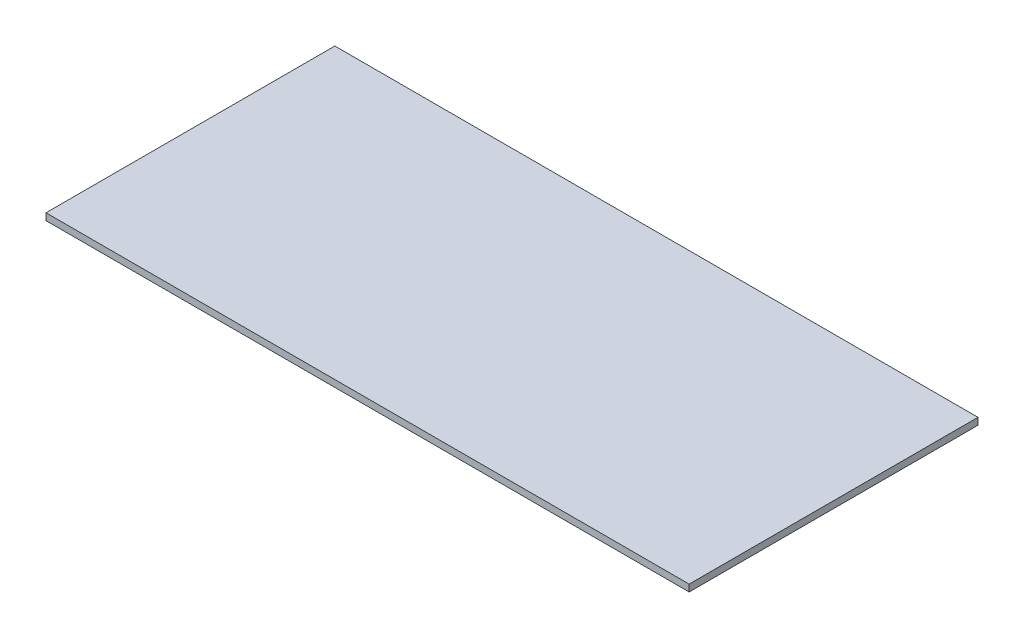
ISO-10303-21;
HEADER;
FILE_DESCRIPTION(('STEP AP214'),'2;1');
FILE_NAME('part.step','',(''),(''),'','','');
FILE_SCHEMA(('AUTOMOTIVE_DESIGN { 1 0 10303 214 1 1 1 1 }'));
ENDSEC;
DATA;
#1=APPLICATION_CONTEXT('core data for automotive mechanical design processes');
#2=APPLICATION_PROTOCOL_DEFINITION('international standard','automotive_design',2000,#1);
#3=PRODUCT_CONTEXT('',#1,'mechanical');
#4=PRODUCT('Part','Part','',(#3));
#5=PRODUCT_RELATED_PRODUCT_CATEGORY('part','',(#4));
#6=PRODUCT_DEFINITION_FORMATION('','',#4);
#7=PRODUCT_DEFINITION_CONTEXT('part definition',#1,'design');
#8=PRODUCT_DEFINITION('design','',#6,#7);
#9=PRODUCT_DEFINITION_SHAPE('','',#8);
#10=(LENGTH_UNIT() NAMED_UNIT(*) SI_UNIT(.MILLI.,.METRE.));
#11=(NAMED_UNIT(*) PLANE_ANGLE_UNIT() SI_UNIT($,.RADIAN.));
#12=(NAMED_UNIT(*) SI_UNIT($,.STERADIAN.) SOLID_ANGLE_UNIT());
#13=UNCERTAINTY_MEASURE_WITH_UNIT(LENGTH_MEASURE(1.E-05),#10,'distance_accuracy_value','');
#14=(GEOMETRIC_REPRESENTATION_CONTEXT(3) GLOBAL_UNCERTAINTY_ASSIGNED_CONTEXT((#13)) GLOBAL_UNIT_ASSIGNED_CONTEXT((#10,
#11,#12)) REPRESENTATION_CONTEXT('',''));
#15=CARTESIAN_POINT('',(0.,0.,0.));
#16=DIRECTION('',(0.,0.,1.));
#17=DIRECTION('',(1.,0.,0.));
#18=AXIS2_PLACEMENT_3D('',#15,#16,#17);
#19=CARTESIAN_POINT('',(119.48172011966,2.54,-53.6594551435598));
#20=DIRECTION('',(-1.,0.,0.));
#21=DIRECTION('',(0.,0.,1.));
#22=AXIS2_PLACEMENT_3D('',#19,#20,#21);
#23=PLANE('',#22);
#24=DIRECTION('',(0.,0.,-1.));
#25=VECTOR('',#24,1.);
#26=CARTESIAN_POINT('',(119.48172011966,0.,-53.6594551435598));
#27=LINE('',#26,#25);
#28=CARTESIAN_POINT('',(119.48172011966,0.,53.6594551435598));
#29=VERTEX_POINT('',#28);
#30=CARTESIAN_POINT('',(119.48172011966,0.,-53.6594551435598));
#31=VERTEX_POINT('',#30);
#32=EDGE_CURVE('E100',#29,#31,#27,.T.);
#33=ORIENTED_EDGE('',*,*,#32,.T.);
#34=DIRECTION('',(0.,-1.,0.));
#35=VECTOR('',#34,1.);
#36=CARTESIAN_POINT('',(119.48172011966,2.54,-53.6594551435598));
#37=LINE('',#36,#35);
#38=CARTESIAN_POINT('',(119.48172011966,2.54,-53.6594551435598));
#39=VERTEX_POINT('',#38);
#40=EDGE_CURVE('E11',#39,#31,#37,.T.);
#41=ORIENTED_EDGE('',*,*,#40,.F.);
#42=DIRECTION('',(0.,0.,-1.));
#43=VECTOR('',#42,1.);
#44=CARTESIAN_POINT('',(119.48172011966,2.54,-53.6594551435598));
#45=LINE('',#44,#43);
#46=CARTESIAN_POINT('',(119.48172011966,2.54,53.6594551435598));
#47=VERTEX_POINT('',#46);
#48=EDGE_CURVE('E88',#47,#39,#45,.T.);
#49=ORIENTED_EDGE('',*,*,#48,.F.);
#50=DIRECTION('',(0.,-1.,0.));
#51=VECTOR('',#50,1.);
#52=CARTESIAN_POINT('',(119.48172011966,2.54,53.6594551435598));
#53=LINE('',#52,#51);
#54=EDGE_CURVE('E96',#47,#29,#53,.T.);
#55=ORIENTED_EDGE('',*,*,#54,.T.);
#56=EDGE_LOOP('',(#33,#41,#49,#55));
#57=FACE_BOUND('',#56,.T.);
#58=ADVANCED_FACE('F37',(#57),#23,.F.);
#59=CARTESIAN_POINT('',(-119.48172011966,2.54,-53.6594551435598));
#60=DIRECTION('',(0.,0.,1.));
#61=DIRECTION('',(1.,0.,0.));
#62=AXIS2_PLACEMENT_3D('',#59,#60,#61);
#63=PLANE('',#62);
#64=DIRECTION('',(-1.,0.,0.));
#65=VECTOR('',#64,1.);
#66=CARTESIAN_POINT('',(-119.48172011966,0.,-53.6594551435598));
#67=LINE('',#66,#65);
#68=CARTESIAN_POINT('',(-119.48172011966,0.,-53.6594551435598));
#69=VERTEX_POINT('',#68);
#70=EDGE_CURVE('E92',#31,#69,#67,.T.);
#71=ORIENTED_EDGE('',*,*,#70,.T.);
#72=DIRECTION('',(0.,-1.,0.));
#73=VECTOR('',#72,1.);
#74=CARTESIAN_POINT('',(-119.48172011966,2.54,-53.6594551435598));
#75=LINE('',#74,#73);
#76=CARTESIAN_POINT('',(-119.48172011966,2.54,-53.6594551435598));
#77=VERTEX_POINT('',#76);
#78=EDGE_CURVE('E45',#77,#69,#75,.T.);
#79=ORIENTED_EDGE('',*,*,#78,.F.);
#80=DIRECTION('',(-1.,0.,0.));
#81=VECTOR('',#80,1.);
#82=CARTESIAN_POINT('',(-119.48172011966,2.54,-53.6594551435598));
#83=LINE('',#82,#81);
#84=EDGE_CURVE('E83',#39,#77,#83,.T.);
#85=ORIENTED_EDGE('',*,*,#84,.F.);
#86=ORIENTED_EDGE('',*,*,#40,.T.);
#87=EDGE_LOOP('',(#71,#79,#85,#86));
#88=FACE_BOUND('',#87,.T.);
#89=ADVANCED_FACE('F91',(#88),#63,.F.);
#90=CARTESIAN_POINT('',(-119.48172011966,2.54,-53.6594551435598));
#91=DIRECTION('',(1.,0.,0.));
#92=DIRECTION('',(0.,0.,-1.));
#93=AXIS2_PLACEMENT_3D('',#90,#91,#92);
#94=PLANE('',#93);
#95=DIRECTION('',(0.,0.,1.));
#96=VECTOR('',#95,1.);
#97=CARTESIAN_POINT('',(-119.48172011966,0.,-53.6594551435598));
#98=LINE('',#97,#96);
#99=CARTESIAN_POINT('',(-119.48172011966,0.,53.6594551435598));
#100=VERTEX_POINT('',#99);
#101=EDGE_CURVE('E70',#69,#100,#98,.T.);
#102=ORIENTED_EDGE('',*,*,#101,.T.);
#103=DIRECTION('',(0.,-1.,0.));
#104=VECTOR('',#103,1.);
#105=CARTESIAN_POINT('',(-119.48172011966,2.54,53.6594551435598));
#106=LINE('',#105,#104);
#107=CARTESIAN_POINT('',(-119.48172011966,2.54,53.6594551435598));
#108=VERTEX_POINT('',#107);
#109=EDGE_CURVE('E93',#108,#100,#106,.T.);
#110=ORIENTED_EDGE('',*,*,#109,.F.);
#111=DIRECTION('',(0.,0.,1.));
#112=VECTOR('',#111,1.);
#113=CARTESIAN_POINT('',(-119.48172011966,2.54,-53.6594551435598));
#114=LINE('',#113,#112);
#115=EDGE_CURVE('E86',#77,#108,#114,.T.);
#116=ORIENTED_EDGE('',*,*,#115,.F.);
#117=ORIENTED_EDGE('',*,*,#78,.T.);
#118=EDGE_LOOP('',(#102,#110,#116,#117));
#119=FACE_BOUND('',#118,.T.);
#120=ADVANCED_FACE('F94',(#119),#94,.F.);
#121=CARTESIAN_POINT('',(-119.48172011966,2.54,53.6594551435598));
#122=DIRECTION('',(0.,0.,-1.));
#123=DIRECTION('',(-1.,0.,0.));
#124=AXIS2_PLACEMENT_3D('',#121,#122,#123);
#125=PLANE('',#124);
#126=DIRECTION('',(1.,0.,0.));
#127=VECTOR('',#126,1.);
#128=CARTESIAN_POINT('',(-119.48172011966,0.,53.6594551435598));
#129=LINE('',#128,#127);
#130=EDGE_CURVE('E76',#100,#29,#129,.T.);
#131=ORIENTED_EDGE('',*,*,#130,.T.);
#132=ORIENTED_EDGE('',*,*,#54,.F.);
#133=DIRECTION('',(1.,0.,0.));
#134=VECTOR('',#133,1.);
#135=CARTESIAN_POINT('',(-119.48172011966,2.54,53.6594551435598));
#136=LINE('',#135,#134);
#137=EDGE_CURVE('E53',#108,#47,#136,.T.);
#138=ORIENTED_EDGE('',*,*,#137,.F.);
#139=ORIENTED_EDGE('',*,*,#109,.T.);
#140=EDGE_LOOP('',(#131,#132,#138,#139));
#141=FACE_BOUND('',#140,.T.);
#142=ADVANCED_FACE('F107',(#141),#125,.F.);
#143=CARTESIAN_POINT('',(0.,2.54,0.));
#144=DIRECTION('',(0.,1.,0.));
#145=DIRECTION('',(0.,0.,1.));
#146=AXIS2_PLACEMENT_3D('',#143,#144,#145);
#147=PLANE('',#146);
#148=ORIENTED_EDGE('',*,*,#48,.T.);
#149=ORIENTED_EDGE('',*,*,#84,.T.);
#150=ORIENTED_EDGE('',*,*,#115,.T.);
#151=ORIENTED_EDGE('',*,*,#137,.T.);
#152=EDGE_LOOP('',(#148,#149,#150,#151));
#153=FACE_BOUND('',#152,.T.);
#154=ADVANCED_FACE('F84',(#153),#147,.T.);
#155=CARTESIAN_POINT('',(0.,0.,0.));
#156=DIRECTION('',(0.,1.,0.));
#157=DIRECTION('',(0.,0.,1.));
#158=AXIS2_PLACEMENT_3D('',#155,#156,#157);
#159=PLANE('',#158);
#160=ORIENTED_EDGE('',*,*,#32,.F.);
#161=ORIENTED_EDGE('',*,*,#130,.F.);
#162=ORIENTED_EDGE('',*,*,#101,.F.);
#163=ORIENTED_EDGE('',*,*,#70,.F.);
#164=EDGE_LOOP('',(#160,#161,#162,#163));
#165=FACE_BOUND('',#164,.T.);
#166=ADVANCED_FACE('F110',(#165),#159,.F.);
#167=CLOSED_SHELL('',(#58,#89,#120,#142,#154,#166));
#168=MANIFOLD_SOLID_BREP('B2',#167);
#169=ADVANCED_BREP_SHAPE_REPRESENTATION('',(#18,#168),#14);
#170=SHAPE_DEFINITION_REPRESENTATION(#9,#169);
ENDSEC;
END-ISO-10303-21;
